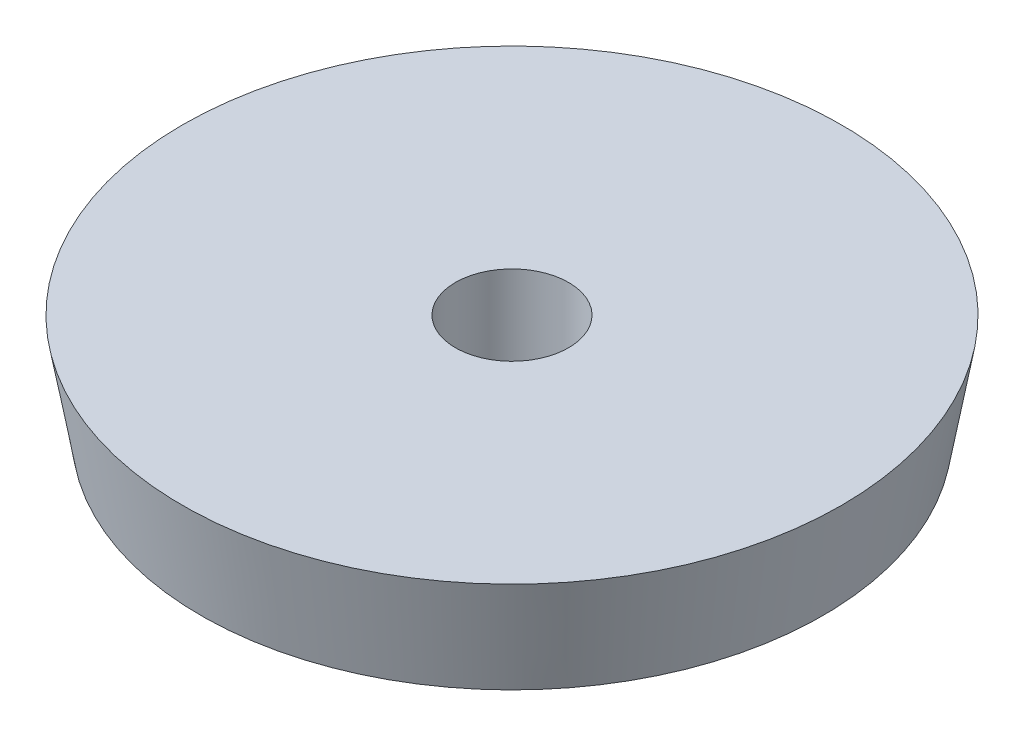
ISO-10303-21;
HEADER;
FILE_DESCRIPTION(('STEP AP214'),'2;1');
FILE_NAME('part.step','',(''),(''),'','','');
FILE_SCHEMA(('AUTOMOTIVE_DESIGN { 1 0 10303 214 1 1 1 1 }'));
ENDSEC;
DATA;
#1=APPLICATION_CONTEXT('core data for automotive mechanical design processes');
#2=APPLICATION_PROTOCOL_DEFINITION('international standard','automotive_design',2000,#1);
#3=PRODUCT_CONTEXT('',#1,'mechanical');
#4=PRODUCT('Part','Part','',(#3));
#5=PRODUCT_RELATED_PRODUCT_CATEGORY('part','',(#4));
#6=PRODUCT_DEFINITION_FORMATION('','',#4);
#7=PRODUCT_DEFINITION_CONTEXT('part definition',#1,'design');
#8=PRODUCT_DEFINITION('design','',#6,#7);
#9=PRODUCT_DEFINITION_SHAPE('','',#8);
#10=(LENGTH_UNIT() NAMED_UNIT(*) SI_UNIT(.MILLI.,.METRE.));
#11=(NAMED_UNIT(*) PLANE_ANGLE_UNIT() SI_UNIT($,.RADIAN.));
#12=(NAMED_UNIT(*) SI_UNIT($,.STERADIAN.) SOLID_ANGLE_UNIT());
#13=UNCERTAINTY_MEASURE_WITH_UNIT(LENGTH_MEASURE(1.E-05),#10,'distance_accuracy_value','');
#14=(GEOMETRIC_REPRESENTATION_CONTEXT(3) GLOBAL_UNCERTAINTY_ASSIGNED_CONTEXT((#13)) GLOBAL_UNIT_ASSIGNED_CONTEXT((#10,
#11,#12)) REPRESENTATION_CONTEXT('',''));
#15=CARTESIAN_POINT('',(0.,0.,0.));
#16=DIRECTION('',(0.,0.,1.));
#17=DIRECTION('',(1.,0.,0.));
#18=AXIS2_PLACEMENT_3D('',#15,#16,#17);
#19=CARTESIAN_POINT('',(200.,0.,0.));
#20=DIRECTION('',(0.,-1.,0.));
#21=DIRECTION('',(1.,0.,0.));
#22=AXIS2_PLACEMENT_3D('',#19,#20,#21);
#23=PLANE('',#22);
#24=CARTESIAN_POINT('',(0.,0.,0.));
#25=DIRECTION('',(0.,1.,0.));
#26=DIRECTION('',(-1.,0.,0.));
#27=AXIS2_PLACEMENT_3D('',#24,#25,#26);
#28=CIRCLE('',#27,34.3535);
#29=CARTESIAN_POINT('',(-34.3535,0.,0.));
#30=VERTEX_POINT('',#29);
#31=EDGE_CURVE('E47',#30,#30,#28,.T.);
#32=ORIENTED_EDGE('',*,*,#31,.F.);
#33=EDGE_LOOP('',(#32));
#34=FACE_BOUND('',#33,.T.);
#35=CARTESIAN_POINT('',(0.,0.,0.));
#36=DIRECTION('',(0.,1.,0.));
#37=DIRECTION('',(-1.,0.,0.));
#38=AXIS2_PLACEMENT_3D('',#35,#36,#37);
#39=CIRCLE('',#38,200.);
#40=CARTESIAN_POINT('',(-200.,0.,0.));
#41=VERTEX_POINT('',#40);
#42=EDGE_CURVE('E39',#41,#41,#39,.T.);
#43=ORIENTED_EDGE('',*,*,#42,.T.);
#44=EDGE_LOOP('',(#43));
#45=FACE_BOUND('',#44,.T.);
#46=ADVANCED_FACE('F33',(#34,#45),#23,.F.);
#47=CARTESIAN_POINT('',(0.,-63.5,0.));
#48=DIRECTION('',(0.,1.,0.));
#49=DIRECTION('',(-1.,0.,0.));
#50=AXIS2_PLACEMENT_3D('',#47,#48,#49);
#51=PLANE('',#50);
#52=CARTESIAN_POINT('',(0.,-63.5000000000001,0.));
#53=DIRECTION('',(0.,1.,0.));
#54=DIRECTION('',(-1.,0.,0.));
#55=AXIS2_PLACEMENT_3D('',#52,#53,#54);
#56=CIRCLE('',#55,34.3535);
#57=CARTESIAN_POINT('',(-34.3535,-63.5000000000001,0.));
#58=VERTEX_POINT('',#57);
#59=EDGE_CURVE('E43',#58,#58,#56,.T.);
#60=ORIENTED_EDGE('',*,*,#59,.T.);
#61=EDGE_LOOP('',(#60));
#62=FACE_BOUND('',#61,.T.);
#63=CARTESIAN_POINT('',(0.,-63.5,0.));
#64=DIRECTION('',(0.,1.,0.));
#65=DIRECTION('',(-1.,0.,0.));
#66=AXIS2_PLACEMENT_3D('',#63,#64,#65);
#67=CIRCLE('',#66,188.803236725013);
#68=CARTESIAN_POINT('',(-188.803236725013,-63.5000000000001,0.));
#69=VERTEX_POINT('',#68);
#70=EDGE_CURVE('E10',#69,#69,#67,.T.);
#71=ORIENTED_EDGE('',*,*,#70,.F.);
#72=EDGE_LOOP('',(#71));
#73=FACE_BOUND('',#72,.T.);
#74=ADVANCED_FACE('F56',(#62,#73),#51,.F.);
#75=CARTESIAN_POINT('',(0.,-63.5,0.));
#76=DIRECTION('',(0.,1.,0.));
#77=DIRECTION('',(-1.,0.,0.));
#78=AXIS2_PLACEMENT_3D('',#75,#76,#77);
#79=CONICAL_SURFACE('',#78,188.803236725013,0.174532925199429);
#80=ORIENTED_EDGE('',*,*,#42,.F.);
#81=EDGE_LOOP('',(#80));
#82=FACE_BOUND('',#81,.T.);
#83=ORIENTED_EDGE('',*,*,#70,.T.);
#84=EDGE_LOOP('',(#83));
#85=FACE_BOUND('',#84,.T.);
#86=ADVANCED_FACE('F60',(#82,#85),#79,.T.);
#87=CARTESIAN_POINT('',(0.,-63.5000000000001,0.));
#88=DIRECTION('',(0.,1.,0.));
#89=DIRECTION('',(-1.,0.,0.));
#90=AXIS2_PLACEMENT_3D('',#87,#88,#89);
#91=CYLINDRICAL_SURFACE('',#90,34.3535);
#92=ORIENTED_EDGE('',*,*,#59,.F.);
#93=EDGE_LOOP('',(#92));
#94=FACE_BOUND('',#93,.T.);
#95=ORIENTED_EDGE('',*,*,#31,.T.);
#96=EDGE_LOOP('',(#95));
#97=FACE_BOUND('',#96,.T.);
#98=ADVANCED_FACE('F53',(#94,#97),#91,.F.);
#99=CLOSED_SHELL('',(#46,#74,#86,#98));
#100=MANIFOLD_SOLID_BREP('B2',#99);
#101=ADVANCED_BREP_SHAPE_REPRESENTATION('',(#18,#100),#14);
#102=SHAPE_DEFINITION_REPRESENTATION(#9,#101);
ENDSEC;
END-ISO-10303-21;
